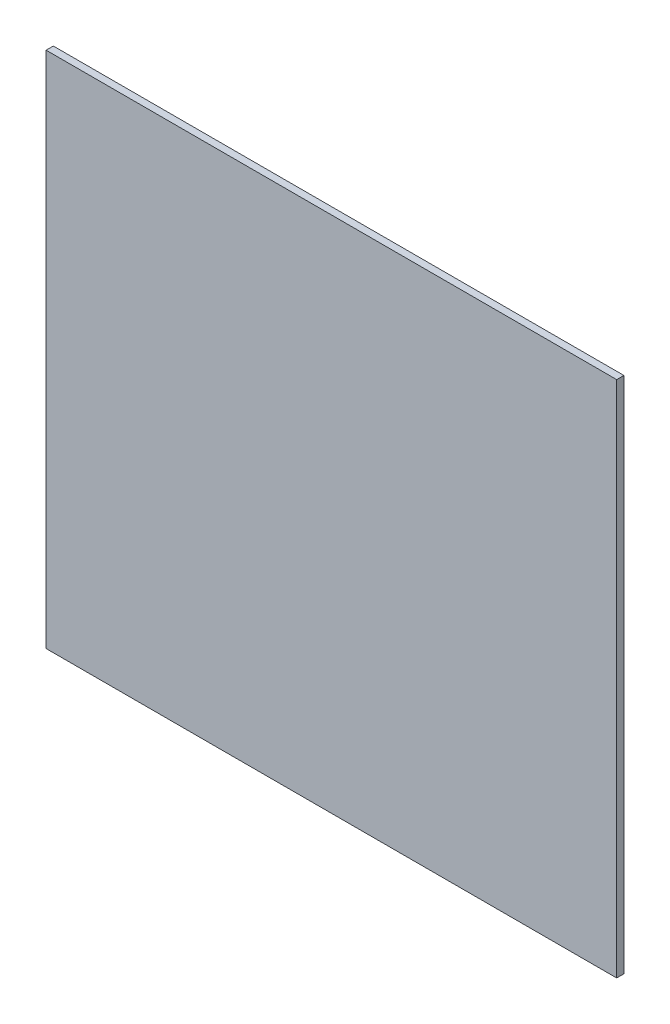
ISO-10303-21;
HEADER;
FILE_DESCRIPTION(('STEP AP214'),'2;1');
FILE_NAME('part.step','',(''),(''),'','','');
FILE_SCHEMA(('AUTOMOTIVE_DESIGN { 1 0 10303 214 1 1 1 1 }'));
ENDSEC;
DATA;
#1=APPLICATION_CONTEXT('core data for automotive mechanical design processes');
#2=APPLICATION_PROTOCOL_DEFINITION('international standard','automotive_design',2000,#1);
#3=PRODUCT_CONTEXT('',#1,'mechanical');
#4=PRODUCT('Part','Part','',(#3));
#5=PRODUCT_RELATED_PRODUCT_CATEGORY('part','',(#4));
#6=PRODUCT_DEFINITION_FORMATION('','',#4);
#7=PRODUCT_DEFINITION_CONTEXT('part definition',#1,'design');
#8=PRODUCT_DEFINITION('design','',#6,#7);
#9=PRODUCT_DEFINITION_SHAPE('','',#8);
#10=(LENGTH_UNIT() NAMED_UNIT(*) SI_UNIT(.MILLI.,.METRE.));
#11=(NAMED_UNIT(*) PLANE_ANGLE_UNIT() SI_UNIT($,.RADIAN.));
#12=(NAMED_UNIT(*) SI_UNIT($,.STERADIAN.) SOLID_ANGLE_UNIT());
#13=UNCERTAINTY_MEASURE_WITH_UNIT(LENGTH_MEASURE(1.E-05),#10,'distance_accuracy_value','');
#14=(GEOMETRIC_REPRESENTATION_CONTEXT(3) GLOBAL_UNCERTAINTY_ASSIGNED_CONTEXT((#13)) GLOBAL_UNIT_ASSIGNED_CONTEXT((#10,
#11,#12)) REPRESENTATION_CONTEXT('',''));
#15=CARTESIAN_POINT('',(0.,0.,0.));
#16=DIRECTION('',(0.,0.,1.));
#17=DIRECTION('',(1.,0.,0.));
#18=AXIS2_PLACEMENT_3D('',#15,#16,#17);
#19=CARTESIAN_POINT('',(3.95,0.0124999999999997,0.05));
#20=DIRECTION('',(-1.,0.,0.));
#21=DIRECTION('',(0.,0.,1.));
#22=AXIS2_PLACEMENT_3D('',#19,#20,#21);
#23=PLANE('',#22);
#24=DIRECTION('',(0.,0.,-1.));
#25=VECTOR('',#24,1.);
#26=CARTESIAN_POINT('',(3.95,-3.575,0.05));
#27=LINE('',#26,#25);
#28=CARTESIAN_POINT('',(3.95,-3.575,0.1));
#29=VERTEX_POINT('',#28);
#30=CARTESIAN_POINT('',(3.95,-3.575,0.));
#31=VERTEX_POINT('',#30);
#32=EDGE_CURVE('E70',#29,#31,#27,.T.);
#33=ORIENTED_EDGE('',*,*,#32,.T.);
#34=DIRECTION('',(0.,-1.,0.));
#35=VECTOR('',#34,1.);
#36=CARTESIAN_POINT('',(3.95,0.0124999999999997,0.));
#37=LINE('',#36,#35);
#38=CARTESIAN_POINT('',(3.95,3.6,0.));
#39=VERTEX_POINT('',#38);
#40=EDGE_CURVE('E73',#39,#31,#37,.T.);
#41=ORIENTED_EDGE('',*,*,#40,.F.);
#42=DIRECTION('',(0.,0.,-1.));
#43=VECTOR('',#42,1.);
#44=CARTESIAN_POINT('',(3.95,3.6,0.05));
#45=LINE('',#44,#43);
#46=CARTESIAN_POINT('',(3.95,3.6,0.1));
#47=VERTEX_POINT('',#46);
#48=EDGE_CURVE('E11',#47,#39,#45,.T.);
#49=ORIENTED_EDGE('',*,*,#48,.F.);
#50=DIRECTION('',(0.,1.,0.));
#51=VECTOR('',#50,1.);
#52=CARTESIAN_POINT('',(3.95,0.0124999999999997,0.1));
#53=LINE('',#52,#51);
#54=EDGE_CURVE('E75',#29,#47,#53,.T.);
#55=ORIENTED_EDGE('',*,*,#54,.F.);
#56=EDGE_LOOP('',(#33,#41,#49,#55));
#57=FACE_BOUND('',#56,.T.);
#58=ADVANCED_FACE('F16',(#57),#23,.F.);
#59=CARTESIAN_POINT('',(0.,3.6,0.05));
#60=DIRECTION('',(0.,-1.,0.));
#61=DIRECTION('',(0.,0.,-1.));
#62=AXIS2_PLACEMENT_3D('',#59,#60,#61);
#63=PLANE('',#62);
#64=ORIENTED_EDGE('',*,*,#48,.T.);
#65=DIRECTION('',(1.,0.,0.));
#66=VECTOR('',#65,1.);
#67=CARTESIAN_POINT('',(0.,3.6,0.));
#68=LINE('',#67,#66);
#69=CARTESIAN_POINT('',(-3.95,3.6,0.));
#70=VERTEX_POINT('',#69);
#71=EDGE_CURVE('E91',#70,#39,#68,.T.);
#72=ORIENTED_EDGE('',*,*,#71,.F.);
#73=DIRECTION('',(0.,0.,-1.));
#74=VECTOR('',#73,1.);
#75=CARTESIAN_POINT('',(-3.95,3.6,0.05));
#76=LINE('',#75,#74);
#77=CARTESIAN_POINT('',(-3.95,3.6,0.1));
#78=VERTEX_POINT('',#77);
#79=EDGE_CURVE('E26',#78,#70,#76,.T.);
#80=ORIENTED_EDGE('',*,*,#79,.F.);
#81=DIRECTION('',(-1.,0.,0.));
#82=VECTOR('',#81,1.);
#83=CARTESIAN_POINT('',(0.,3.6,0.1));
#84=LINE('',#83,#82);
#85=EDGE_CURVE('E106',#47,#78,#84,.T.);
#86=ORIENTED_EDGE('',*,*,#85,.F.);
#87=EDGE_LOOP('',(#64,#72,#80,#86));
#88=FACE_BOUND('',#87,.T.);
#89=ADVANCED_FACE('F189',(#88),#63,.F.);
#90=CARTESIAN_POINT('',(-3.95,0.0124999999999997,0.05));
#91=DIRECTION('',(1.,0.,0.));
#92=DIRECTION('',(0.,1.,0.));
#93=AXIS2_PLACEMENT_3D('',#90,#91,#92);
#94=PLANE('',#93);
#95=ORIENTED_EDGE('',*,*,#79,.T.);
#96=DIRECTION('',(0.,1.,0.));
#97=VECTOR('',#96,1.);
#98=CARTESIAN_POINT('',(-3.95,0.0124999999999997,0.));
#99=LINE('',#98,#97);
#100=CARTESIAN_POINT('',(-3.95,-3.575,0.));
#101=VERTEX_POINT('',#100);
#102=EDGE_CURVE('E88',#101,#70,#99,.T.);
#103=ORIENTED_EDGE('',*,*,#102,.F.);
#104=DIRECTION('',(0.,0.,-1.));
#105=VECTOR('',#104,1.);
#106=CARTESIAN_POINT('',(-3.95,-3.575,0.05));
#107=LINE('',#106,#105);
#108=CARTESIAN_POINT('',(-3.95,-3.575,0.1));
#109=VERTEX_POINT('',#108);
#110=EDGE_CURVE('E80',#109,#101,#107,.T.);
#111=ORIENTED_EDGE('',*,*,#110,.F.);
#112=DIRECTION('',(0.,-1.,0.));
#113=VECTOR('',#112,1.);
#114=CARTESIAN_POINT('',(-3.95,0.0124999999999997,0.1));
#115=LINE('',#114,#113);
#116=EDGE_CURVE('E99',#78,#109,#115,.T.);
#117=ORIENTED_EDGE('',*,*,#116,.F.);
#118=EDGE_LOOP('',(#95,#103,#111,#117));
#119=FACE_BOUND('',#118,.T.);
#120=ADVANCED_FACE('F179',(#119),#94,.F.);
#121=CARTESIAN_POINT('',(0.,-3.575,0.05));
#122=DIRECTION('',(0.,1.,0.));
#123=DIRECTION('',(1.,0.,0.));
#124=AXIS2_PLACEMENT_3D('',#121,#122,#123);
#125=PLANE('',#124);
#126=ORIENTED_EDGE('',*,*,#110,.T.);
#127=DIRECTION('',(-1.,0.,0.));
#128=VECTOR('',#127,1.);
#129=CARTESIAN_POINT('',(0.,-3.575,0.));
#130=LINE('',#129,#128);
#131=EDGE_CURVE('E83',#31,#101,#130,.T.);
#132=ORIENTED_EDGE('',*,*,#131,.F.);
#133=ORIENTED_EDGE('',*,*,#32,.F.);
#134=DIRECTION('',(1.,0.,0.));
#135=VECTOR('',#134,1.);
#136=CARTESIAN_POINT('',(0.,-3.575,0.1));
#137=LINE('',#136,#135);
#138=EDGE_CURVE('E93',#109,#29,#137,.T.);
#139=ORIENTED_EDGE('',*,*,#138,.F.);
#140=EDGE_LOOP('',(#126,#132,#133,#139));
#141=FACE_BOUND('',#140,.T.);
#142=ADVANCED_FACE('F84',(#141),#125,.F.);
#143=CARTESIAN_POINT('',(0.,0.0124999999999997,0.));
#144=DIRECTION('',(0.,0.,1.));
#145=DIRECTION('',(1.,0.,0.));
#146=AXIS2_PLACEMENT_3D('',#143,#144,#145);
#147=PLANE('',#146);
#148=ORIENTED_EDGE('',*,*,#40,.T.);
#149=ORIENTED_EDGE('',*,*,#131,.T.);
#150=ORIENTED_EDGE('',*,*,#102,.T.);
#151=ORIENTED_EDGE('',*,*,#71,.T.);
#152=EDGE_LOOP('',(#148,#149,#150,#151));
#153=FACE_BOUND('',#152,.T.);
#154=ADVANCED_FACE('F90',(#153),#147,.F.);
#155=CARTESIAN_POINT('',(0.,0.0124999999999997,0.1));
#156=DIRECTION('',(0.,0.,1.));
#157=DIRECTION('',(1.,0.,0.));
#158=AXIS2_PLACEMENT_3D('',#155,#156,#157);
#159=PLANE('',#158);
#160=ORIENTED_EDGE('',*,*,#54,.T.);
#161=ORIENTED_EDGE('',*,*,#85,.T.);
#162=ORIENTED_EDGE('',*,*,#116,.T.);
#163=ORIENTED_EDGE('',*,*,#138,.T.);
#164=EDGE_LOOP('',(#160,#161,#162,#163));
#165=FACE_BOUND('',#164,.T.);
#166=ADVANCED_FACE('F18',(#165),#159,.T.);
#167=CLOSED_SHELL('',(#58,#89,#120,#142,#154,#166));
#168=MANIFOLD_SOLID_BREP('B1',#167);
#169=ADVANCED_BREP_SHAPE_REPRESENTATION('',(#18,#168),#14);
#170=SHAPE_DEFINITION_REPRESENTATION(#9,#169);
ENDSEC;
END-ISO-10303-21;
